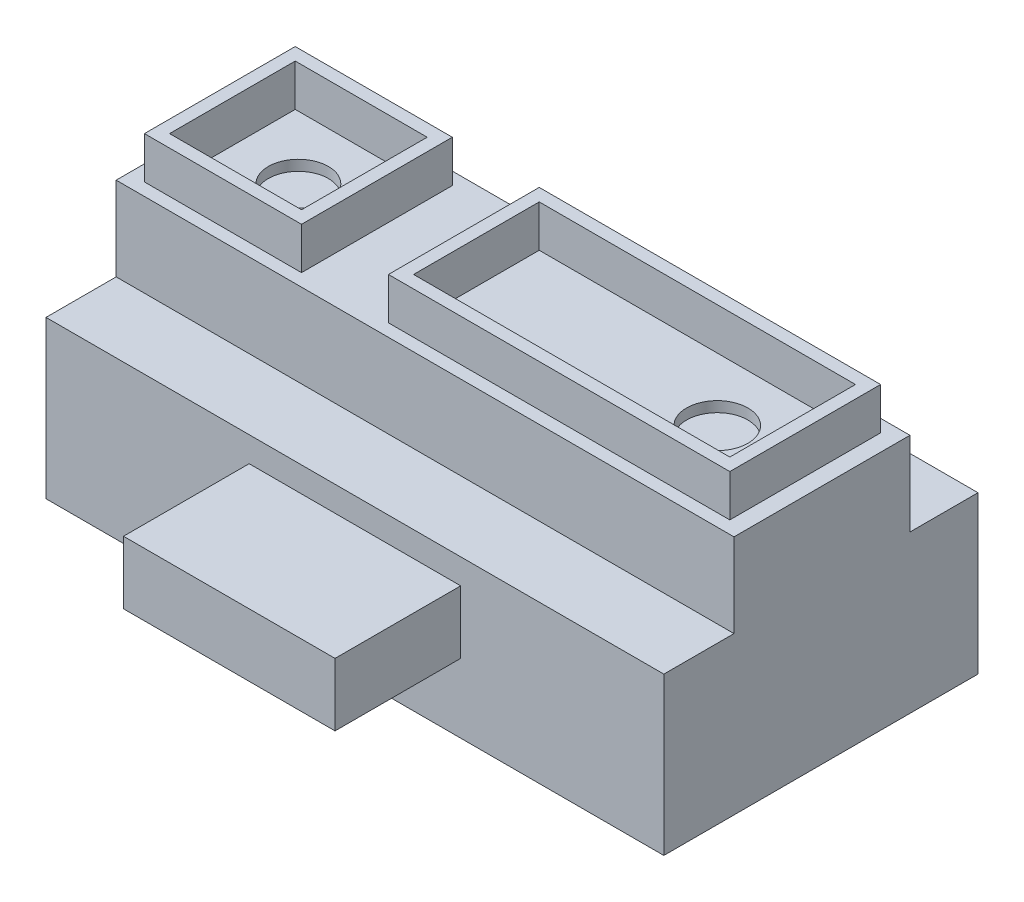
ISO-10303-21;
HEADER;
FILE_DESCRIPTION(('STEP AP214'),'2;1');
FILE_NAME('part.step','',(''),(''),'','','');
FILE_SCHEMA(('AUTOMOTIVE_DESIGN { 1 0 10303 214 1 1 1 1 }'));
ENDSEC;
DATA;
#1=APPLICATION_CONTEXT('core data for automotive mechanical design processes');
#2=APPLICATION_PROTOCOL_DEFINITION('international standard','automotive_design',2000,#1);
#3=PRODUCT_CONTEXT('',#1,'mechanical');
#4=PRODUCT('Part','Part','',(#3));
#5=PRODUCT_RELATED_PRODUCT_CATEGORY('part','',(#4));
#6=PRODUCT_DEFINITION_FORMATION('','',#4);
#7=PRODUCT_DEFINITION_CONTEXT('part definition',#1,'design');
#8=PRODUCT_DEFINITION('design','',#6,#7);
#9=PRODUCT_DEFINITION_SHAPE('','',#8);
#10=(LENGTH_UNIT() NAMED_UNIT(*) SI_UNIT(.MILLI.,.METRE.));
#11=(NAMED_UNIT(*) PLANE_ANGLE_UNIT() SI_UNIT($,.RADIAN.));
#12=(NAMED_UNIT(*) SI_UNIT($,.STERADIAN.) SOLID_ANGLE_UNIT());
#13=UNCERTAINTY_MEASURE_WITH_UNIT(LENGTH_MEASURE(1.E-05),#10,'distance_accuracy_value','');
#14=(GEOMETRIC_REPRESENTATION_CONTEXT(3) GLOBAL_UNCERTAINTY_ASSIGNED_CONTEXT((#13)) GLOBAL_UNIT_ASSIGNED_CONTEXT((#10,
#11,#12)) REPRESENTATION_CONTEXT('',''));
#15=CARTESIAN_POINT('',(0.,0.,0.));
#16=DIRECTION('',(0.,0.,1.));
#17=DIRECTION('',(1.,0.,0.));
#18=AXIS2_PLACEMENT_3D('',#15,#16,#17);
#19=CARTESIAN_POINT('',(0.,7.5,0.));
#20=DIRECTION('',(0.,0.,-1.));
#21=DIRECTION('',(-1.,0.,0.));
#22=AXIS2_PLACEMENT_3D('',#19,#20,#21);
#23=PLANE('',#22);
#24=DIRECTION('',(1.,0.,0.));
#25=VECTOR('',#24,1.);
#26=CARTESIAN_POINT('',(0.,0.,0.));
#27=LINE('',#26,#25);
#28=CARTESIAN_POINT('',(0.,0.,0.));
#29=VERTEX_POINT('',#28);
#30=CARTESIAN_POINT('',(29.5,0.,0.));
#31=VERTEX_POINT('',#30);
#32=EDGE_CURVE('E500',#29,#31,#27,.T.);
#33=ORIENTED_EDGE('',*,*,#32,.T.);
#34=DIRECTION('',(0.,-1.,0.));
#35=VECTOR('',#34,1.);
#36=CARTESIAN_POINT('',(29.5,7.5,0.));
#37=LINE('',#36,#35);
#38=CARTESIAN_POINT('',(29.5,7.5,0.));
#39=VERTEX_POINT('',#38);
#40=EDGE_CURVE('E45',#39,#31,#37,.T.);
#41=ORIENTED_EDGE('',*,*,#40,.F.);
#42=DIRECTION('',(1.,0.,0.));
#43=VECTOR('',#42,1.);
#44=CARTESIAN_POINT('',(0.,7.5,0.));
#45=LINE('',#44,#43);
#46=CARTESIAN_POINT('',(0.,7.5,0.));
#47=VERTEX_POINT('',#46);
#48=EDGE_CURVE('E472',#47,#39,#45,.T.);
#49=ORIENTED_EDGE('',*,*,#48,.F.);
#50=DIRECTION('',(0.,-1.,0.));
#51=VECTOR('',#50,1.);
#52=CARTESIAN_POINT('',(0.,7.5,0.));
#53=LINE('',#52,#51);
#54=EDGE_CURVE('E11',#47,#29,#53,.T.);
#55=ORIENTED_EDGE('',*,*,#54,.T.);
#56=EDGE_LOOP('',(#33,#41,#49,#55));
#57=FACE_BOUND('',#56,.T.);
#58=DIRECTION('',(0.,-1.,0.));
#59=VECTOR('',#58,1.);
#60=CARTESIAN_POINT('',(9.7,6.3,0.));
#61=LINE('',#60,#59);
#62=CARTESIAN_POINT('',(9.7,6.3,0.));
#63=VERTEX_POINT('',#62);
#64=CARTESIAN_POINT('',(9.7,3.3,0.));
#65=VERTEX_POINT('',#64);
#66=EDGE_CURVE('E267',#63,#65,#61,.T.);
#67=ORIENTED_EDGE('',*,*,#66,.F.);
#68=DIRECTION('',(-1.,0.,0.));
#69=VECTOR('',#68,1.);
#70=CARTESIAN_POINT('',(9.7,6.3,0.));
#71=LINE('',#70,#69);
#72=CARTESIAN_POINT('',(19.8,6.3,0.));
#73=VERTEX_POINT('',#72);
#74=EDGE_CURVE('E264',#73,#63,#71,.T.);
#75=ORIENTED_EDGE('',*,*,#74,.F.);
#76=DIRECTION('',(0.,1.,0.));
#77=VECTOR('',#76,1.);
#78=CARTESIAN_POINT('',(19.8,6.3,0.));
#79=LINE('',#78,#77);
#80=CARTESIAN_POINT('',(19.8,3.3,0.));
#81=VERTEX_POINT('',#80);
#82=EDGE_CURVE('E58',#81,#73,#79,.T.);
#83=ORIENTED_EDGE('',*,*,#82,.F.);
#84=DIRECTION('',(1.,0.,0.));
#85=VECTOR('',#84,1.);
#86=CARTESIAN_POINT('',(9.7,3.3,0.));
#87=LINE('',#86,#85);
#88=EDGE_CURVE('E53',#65,#81,#87,.T.);
#89=ORIENTED_EDGE('',*,*,#88,.F.);
#90=EDGE_LOOP('',(#67,#75,#83,#89));
#91=FACE_BOUND('',#90,.T.);
#92=ADVANCED_FACE('F36',(#57,#91),#23,.F.);
#93=CARTESIAN_POINT('',(0.,11.5,-3.35));
#94=DIRECTION('',(0.,1.,0.));
#95=DIRECTION('',(0.,0.,1.));
#96=AXIS2_PLACEMENT_3D('',#93,#94,#95);
#97=PLANE('',#96);
#98=DIRECTION('',(0.,0.,-1.));
#99=VECTOR('',#98,1.);
#100=CARTESIAN_POINT('',(8.25,11.5,-7.55));
#101=LINE('',#100,#99);
#102=CARTESIAN_POINT('',(8.25,11.5,-3.95));
#103=VERTEX_POINT('',#102);
#104=CARTESIAN_POINT('',(8.25,11.5,-11.15));
#105=VERTEX_POINT('',#104);
#106=EDGE_CURVE('E377',#103,#105,#101,.T.);
#107=ORIENTED_EDGE('',*,*,#106,.F.);
#108=DIRECTION('',(1.,0.,0.));
#109=VECTOR('',#108,1.);
#110=CARTESIAN_POINT('',(-9.24912556263572,11.5,-3.95));
#111=LINE('',#110,#109);
#112=CARTESIAN_POINT('',(0.749999999999999,11.5,-3.95));
#113=VERTEX_POINT('',#112);
#114=EDGE_CURVE('E340',#113,#103,#111,.T.);
#115=ORIENTED_EDGE('',*,*,#114,.F.);
#116=DIRECTION('',(0.,0.,-1.));
#117=VECTOR('',#116,1.);
#118=CARTESIAN_POINT('',(0.750000000000001,11.5,-7.55));
#119=LINE('',#118,#117);
#120=CARTESIAN_POINT('',(0.750000000000001,11.5,-11.15));
#121=VERTEX_POINT('',#120);
#122=EDGE_CURVE('E382',#113,#121,#119,.T.);
#123=ORIENTED_EDGE('',*,*,#122,.T.);
#124=DIRECTION('',(1.,0.,0.));
#125=VECTOR('',#124,1.);
#126=CARTESIAN_POINT('',(-9.24912556263572,11.5,-11.15));
#127=LINE('',#126,#125);
#128=EDGE_CURVE('E380',#121,#105,#127,.T.);
#129=ORIENTED_EDGE('',*,*,#128,.T.);
#130=EDGE_LOOP('',(#107,#115,#123,#129));
#131=FACE_BOUND('',#130,.T.);
#132=DIRECTION('',(0.,0.,1.));
#133=VECTOR('',#132,1.);
#134=CARTESIAN_POINT('',(0.,11.5,-11.75));
#135=LINE('',#134,#133);
#136=CARTESIAN_POINT('',(0.,11.5,-11.75));
#137=VERTEX_POINT('',#136);
#138=CARTESIAN_POINT('',(0.,11.5,-3.35));
#139=VERTEX_POINT('',#138);
#140=EDGE_CURVE('E417',#137,#139,#135,.T.);
#141=ORIENTED_EDGE('',*,*,#140,.T.);
#142=DIRECTION('',(1.,0.,0.));
#143=VECTOR('',#142,1.);
#144=CARTESIAN_POINT('',(0.,11.5,-3.35));
#145=LINE('',#144,#143);
#146=CARTESIAN_POINT('',(29.5,11.5,-3.35));
#147=VERTEX_POINT('',#146);
#148=EDGE_CURVE('E420',#139,#147,#145,.T.);
#149=ORIENTED_EDGE('',*,*,#148,.T.);
#150=DIRECTION('',(0.,0.,-1.));
#151=VECTOR('',#150,1.);
#152=CARTESIAN_POINT('',(29.5,11.5,-3.35));
#153=LINE('',#152,#151);
#154=CARTESIAN_POINT('',(29.5,11.5,-11.75));
#155=VERTEX_POINT('',#154);
#156=EDGE_CURVE('E423',#147,#155,#153,.T.);
#157=ORIENTED_EDGE('',*,*,#156,.T.);
#158=DIRECTION('',(-1.,0.,0.));
#159=VECTOR('',#158,1.);
#160=CARTESIAN_POINT('',(29.5,11.5,-11.75));
#161=LINE('',#160,#159);
#162=EDGE_CURVE('E425',#155,#137,#161,.T.);
#163=ORIENTED_EDGE('',*,*,#162,.T.);
#164=EDGE_LOOP('',(#141,#149,#157,#163));
#165=FACE_BOUND('',#164,.T.);
#166=DIRECTION('',(0.,0.,-1.));
#167=VECTOR('',#166,1.);
#168=CARTESIAN_POINT('',(28.7,11.5,-7.55));
#169=LINE('',#168,#167);
#170=CARTESIAN_POINT('',(28.7,11.5,-3.95));
#171=VERTEX_POINT('',#170);
#172=CARTESIAN_POINT('',(28.7,11.5,-11.15));
#173=VERTEX_POINT('',#172);
#174=EDGE_CURVE('E321',#171,#173,#169,.T.);
#175=ORIENTED_EDGE('',*,*,#174,.F.);
#176=DIRECTION('',(1.,0.,0.));
#177=VECTOR('',#176,1.);
#178=CARTESIAN_POINT('',(-9.24912556263572,11.5,-3.95));
#179=LINE('',#178,#177);
#180=CARTESIAN_POINT('',(12.4,11.5,-3.95));
#181=VERTEX_POINT('',#180);
#182=EDGE_CURVE('E318',#181,#171,#179,.T.);
#183=ORIENTED_EDGE('',*,*,#182,.F.);
#184=DIRECTION('',(0.,0.,-1.));
#185=VECTOR('',#184,1.);
#186=CARTESIAN_POINT('',(12.4,11.5,-7.55));
#187=LINE('',#186,#185);
#188=CARTESIAN_POINT('',(12.4,11.5,-11.15));
#189=VERTEX_POINT('',#188);
#190=EDGE_CURVE('E290',#181,#189,#187,.T.);
#191=ORIENTED_EDGE('',*,*,#190,.T.);
#192=DIRECTION('',(1.,0.,0.));
#193=VECTOR('',#192,1.);
#194=CARTESIAN_POINT('',(-9.24912556263572,11.5,-11.15));
#195=LINE('',#194,#193);
#196=EDGE_CURVE('E324',#189,#173,#195,.T.);
#197=ORIENTED_EDGE('',*,*,#196,.T.);
#198=EDGE_LOOP('',(#175,#183,#191,#197));
#199=FACE_BOUND('',#198,.T.);
#200=ADVANCED_FACE('F569',(#131,#165,#199),#97,.T.);
#201=CARTESIAN_POINT('',(0.,7.5,-15.));
#202=DIRECTION('',(0.,-1.,0.));
#203=DIRECTION('',(0.,0.,-1.));
#204=AXIS2_PLACEMENT_3D('',#201,#202,#203);
#205=PLANE('',#204);
#206=DIRECTION('',(-1.,0.,0.));
#207=VECTOR('',#206,1.);
#208=CARTESIAN_POINT('',(29.5,7.5,-11.75));
#209=LINE('',#208,#207);
#210=CARTESIAN_POINT('',(29.5,7.5,-11.75));
#211=VERTEX_POINT('',#210);
#212=CARTESIAN_POINT('',(0.,7.5,-11.75));
#213=VERTEX_POINT('',#212);
#214=EDGE_CURVE('E421',#211,#213,#209,.T.);
#215=ORIENTED_EDGE('',*,*,#214,.F.);
#216=DIRECTION('',(0.,0.,-1.));
#217=VECTOR('',#216,1.);
#218=CARTESIAN_POINT('',(29.5,7.5,0.));
#219=LINE('',#218,#217);
#220=CARTESIAN_POINT('',(29.5,7.5,-15.));
#221=VERTEX_POINT('',#220);
#222=EDGE_CURVE('E436',#211,#221,#219,.T.);
#223=ORIENTED_EDGE('',*,*,#222,.T.);
#224=DIRECTION('',(-1.,0.,0.));
#225=VECTOR('',#224,1.);
#226=CARTESIAN_POINT('',(0.,7.5,-15.));
#227=LINE('',#226,#225);
#228=CARTESIAN_POINT('',(0.,7.5,-15.));
#229=VERTEX_POINT('',#228);
#230=EDGE_CURVE('E473',#221,#229,#227,.T.);
#231=ORIENTED_EDGE('',*,*,#230,.T.);
#232=DIRECTION('',(0.,0.,1.));
#233=VECTOR('',#232,1.);
#234=CARTESIAN_POINT('',(0.,7.5,0.));
#235=LINE('',#234,#233);
#236=EDGE_CURVE('E474',#229,#213,#235,.T.);
#237=ORIENTED_EDGE('',*,*,#236,.T.);
#238=EDGE_LOOP('',(#215,#223,#231,#237));
#239=FACE_BOUND('',#238,.T.);
#240=ADVANCED_FACE('F573',(#239),#205,.F.);
#241=DIRECTION('',(1.,0.,0.));
#242=VECTOR('',#241,1.);
#243=CARTESIAN_POINT('',(0.,7.5,-3.35));
#244=LINE('',#243,#242);
#245=CARTESIAN_POINT('',(0.,7.5,-3.35));
#246=VERTEX_POINT('',#245);
#247=CARTESIAN_POINT('',(29.5,7.5,-3.35));
#248=VERTEX_POINT('',#247);
#249=EDGE_CURVE('E406',#246,#248,#244,.T.);
#250=ORIENTED_EDGE('',*,*,#249,.F.);
#251=EDGE_CURVE('E479',#246,#47,#235,.T.);
#252=ORIENTED_EDGE('',*,*,#251,.T.);
#253=ORIENTED_EDGE('',*,*,#48,.T.);
#254=EDGE_CURVE('E471',#39,#248,#219,.T.);
#255=ORIENTED_EDGE('',*,*,#254,.T.);
#256=EDGE_LOOP('',(#250,#252,#253,#255));
#257=FACE_BOUND('',#256,.T.);
#258=ADVANCED_FACE('F592',(#257),#205,.F.);
#259=CARTESIAN_POINT('',(0.,7.5,0.));
#260=DIRECTION('',(1.,0.,0.));
#261=DIRECTION('',(0.,0.,-1.));
#262=AXIS2_PLACEMENT_3D('',#259,#260,#261);
#263=PLANE('',#262);
#264=DIRECTION('',(0.,0.,1.));
#265=VECTOR('',#264,1.);
#266=CARTESIAN_POINT('',(0.,0.,0.));
#267=LINE('',#266,#265);
#268=CARTESIAN_POINT('',(0.,0.,-15.));
#269=VERTEX_POINT('',#268);
#270=EDGE_CURVE('E501',#269,#29,#267,.T.);
#271=ORIENTED_EDGE('',*,*,#270,.T.);
#272=ORIENTED_EDGE('',*,*,#54,.F.);
#273=ORIENTED_EDGE('',*,*,#251,.F.);
#274=DIRECTION('',(0.,-1.,0.));
#275=VECTOR('',#274,1.);
#276=CARTESIAN_POINT('',(0.,11.5,-3.35));
#277=LINE('',#276,#275);
#278=EDGE_CURVE('E442',#139,#246,#277,.T.);
#279=ORIENTED_EDGE('',*,*,#278,.F.);
#280=ORIENTED_EDGE('',*,*,#140,.F.);
#281=DIRECTION('',(0.,-1.,0.));
#282=VECTOR('',#281,1.);
#283=CARTESIAN_POINT('',(0.,11.5,-11.75));
#284=LINE('',#283,#282);
#285=EDGE_CURVE('E427',#137,#213,#284,.T.);
#286=ORIENTED_EDGE('',*,*,#285,.T.);
#287=ORIENTED_EDGE('',*,*,#236,.F.);
#288=DIRECTION('',(0.,-1.,0.));
#289=VECTOR('',#288,1.);
#290=CARTESIAN_POINT('',(0.,7.5,-15.));
#291=LINE('',#290,#289);
#292=EDGE_CURVE('E494',#229,#269,#291,.T.);
#293=ORIENTED_EDGE('',*,*,#292,.T.);
#294=EDGE_LOOP('',(#271,#272,#273,#279,#280,#286,#287,#293));
#295=FACE_BOUND('',#294,.T.);
#296=ADVANCED_FACE('F38',(#295),#263,.F.);
#297=CARTESIAN_POINT('',(29.5,7.5,0.));
#298=DIRECTION('',(-1.,0.,0.));
#299=DIRECTION('',(0.,0.,1.));
#300=AXIS2_PLACEMENT_3D('',#297,#298,#299);
#301=PLANE('',#300);
#302=DIRECTION('',(0.,0.,-1.));
#303=VECTOR('',#302,1.);
#304=CARTESIAN_POINT('',(29.5,0.,0.));
#305=LINE('',#304,#303);
#306=CARTESIAN_POINT('',(29.5,0.,-15.));
#307=VERTEX_POINT('',#306);
#308=EDGE_CURVE('E498',#31,#307,#305,.T.);
#309=ORIENTED_EDGE('',*,*,#308,.T.);
#310=DIRECTION('',(0.,-1.,0.));
#311=VECTOR('',#310,1.);
#312=CARTESIAN_POINT('',(29.5,7.5,-15.));
#313=LINE('',#312,#311);
#314=EDGE_CURVE('E468',#221,#307,#313,.T.);
#315=ORIENTED_EDGE('',*,*,#314,.F.);
#316=ORIENTED_EDGE('',*,*,#222,.F.);
#317=DIRECTION('',(0.,-1.,0.));
#318=VECTOR('',#317,1.);
#319=CARTESIAN_POINT('',(29.5,11.5,-11.75));
#320=LINE('',#319,#318);
#321=EDGE_CURVE('E443',#155,#211,#320,.T.);
#322=ORIENTED_EDGE('',*,*,#321,.F.);
#323=ORIENTED_EDGE('',*,*,#156,.F.);
#324=DIRECTION('',(0.,-1.,0.));
#325=VECTOR('',#324,1.);
#326=CARTESIAN_POINT('',(29.5,11.5,-3.35));
#327=LINE('',#326,#325);
#328=EDGE_CURVE('E439',#147,#248,#327,.T.);
#329=ORIENTED_EDGE('',*,*,#328,.T.);
#330=ORIENTED_EDGE('',*,*,#254,.F.);
#331=ORIENTED_EDGE('',*,*,#40,.T.);
#332=EDGE_LOOP('',(#309,#315,#316,#322,#323,#329,#330,#331));
#333=FACE_BOUND('',#332,.T.);
#334=ADVANCED_FACE('F465',(#333),#301,.F.);
#335=CARTESIAN_POINT('',(0.,7.5,-15.));
#336=DIRECTION('',(0.,0.,1.));
#337=DIRECTION('',(1.,0.,0.));
#338=AXIS2_PLACEMENT_3D('',#335,#336,#337);
#339=PLANE('',#338);
#340=DIRECTION('',(-1.,0.,0.));
#341=VECTOR('',#340,1.);
#342=CARTESIAN_POINT('',(0.,0.,-15.));
#343=LINE('',#342,#341);
#344=EDGE_CURVE('E489',#307,#269,#343,.T.);
#345=ORIENTED_EDGE('',*,*,#344,.T.);
#346=ORIENTED_EDGE('',*,*,#292,.F.);
#347=ORIENTED_EDGE('',*,*,#230,.F.);
#348=ORIENTED_EDGE('',*,*,#314,.T.);
#349=EDGE_LOOP('',(#345,#346,#347,#348));
#350=FACE_BOUND('',#349,.T.);
#351=ADVANCED_FACE('F557',(#350),#339,.F.);
#352=CARTESIAN_POINT('',(0.,0.,-15.));
#353=DIRECTION('',(0.,-1.,0.));
#354=DIRECTION('',(0.,0.,-1.));
#355=AXIS2_PLACEMENT_3D('',#352,#353,#354);
#356=PLANE('',#355);
#357=DIRECTION('',(-1.,0.,0.));
#358=VECTOR('',#357,1.);
#359=CARTESIAN_POINT('',(28.7,0.,-0.8));
#360=LINE('',#359,#358);
#361=CARTESIAN_POINT('',(28.7,0.,-0.8));
#362=VERTEX_POINT('',#361);
#363=CARTESIAN_POINT('',(0.8,0.,-0.8));
#364=VERTEX_POINT('',#363);
#365=EDGE_CURVE('E448',#362,#364,#360,.T.);
#366=ORIENTED_EDGE('',*,*,#365,.F.);
#367=DIRECTION('',(0.,0.,1.));
#368=VECTOR('',#367,1.);
#369=CARTESIAN_POINT('',(28.7,0.,-14.2));
#370=LINE('',#369,#368);
#371=CARTESIAN_POINT('',(28.7,0.,-14.2));
#372=VERTEX_POINT('',#371);
#373=EDGE_CURVE('E515',#372,#362,#370,.T.);
#374=ORIENTED_EDGE('',*,*,#373,.F.);
#375=DIRECTION('',(1.,0.,0.));
#376=VECTOR('',#375,1.);
#377=CARTESIAN_POINT('',(0.799999999999993,0.,-14.2));
#378=LINE('',#377,#376);
#379=CARTESIAN_POINT('',(0.799999999999993,0.,-14.2));
#380=VERTEX_POINT('',#379);
#381=EDGE_CURVE('E538',#380,#372,#378,.T.);
#382=ORIENTED_EDGE('',*,*,#381,.F.);
#383=DIRECTION('',(0.,0.,-1.));
#384=VECTOR('',#383,1.);
#385=CARTESIAN_POINT('',(0.8,0.,-0.8));
#386=LINE('',#385,#384);
#387=EDGE_CURVE('E537',#364,#380,#386,.T.);
#388=ORIENTED_EDGE('',*,*,#387,.F.);
#389=EDGE_LOOP('',(#366,#374,#382,#388));
#390=FACE_BOUND('',#389,.T.);
#391=ORIENTED_EDGE('',*,*,#270,.F.);
#392=ORIENTED_EDGE('',*,*,#344,.F.);
#393=ORIENTED_EDGE('',*,*,#308,.F.);
#394=ORIENTED_EDGE('',*,*,#32,.F.);
#395=EDGE_LOOP('',(#391,#392,#393,#394));
#396=FACE_BOUND('',#395,.T.);
#397=ADVANCED_FACE('F554',(#390,#396),#356,.T.);
#398=CARTESIAN_POINT('',(28.7,5.7,-0.8));
#399=DIRECTION('',(0.,0.,1.));
#400=DIRECTION('',(1.,0.,0.));
#401=AXIS2_PLACEMENT_3D('',#398,#399,#400);
#402=PLANE('',#401);
#403=ORIENTED_EDGE('',*,*,#365,.T.);
#404=DIRECTION('',(0.,-1.,0.));
#405=VECTOR('',#404,1.);
#406=CARTESIAN_POINT('',(0.8,5.7,-0.8));
#407=LINE('',#406,#405);
#408=CARTESIAN_POINT('',(0.8,5.7,-0.8));
#409=VERTEX_POINT('',#408);
#410=EDGE_CURVE('E518',#409,#364,#407,.T.);
#411=ORIENTED_EDGE('',*,*,#410,.F.);
#412=DIRECTION('',(-1.,0.,0.));
#413=VECTOR('',#412,1.);
#414=CARTESIAN_POINT('',(28.7,5.7,-0.8));
#415=LINE('',#414,#413);
#416=CARTESIAN_POINT('',(28.7,5.7,-0.8));
#417=VERTEX_POINT('',#416);
#418=EDGE_CURVE('E543',#417,#409,#415,.T.);
#419=ORIENTED_EDGE('',*,*,#418,.F.);
#420=DIRECTION('',(0.,-1.,0.));
#421=VECTOR('',#420,1.);
#422=CARTESIAN_POINT('',(28.7,5.7,-0.8));
#423=LINE('',#422,#421);
#424=EDGE_CURVE('E503',#417,#362,#423,.T.);
#425=ORIENTED_EDGE('',*,*,#424,.T.);
#426=EDGE_LOOP('',(#403,#411,#419,#425));
#427=FACE_BOUND('',#426,.T.);
#428=ADVANCED_FACE('F552',(#427),#402,.F.);
#429=CARTESIAN_POINT('',(28.7,5.7,-14.2));
#430=DIRECTION('',(1.,0.,0.));
#431=DIRECTION('',(0.,0.,-1.));
#432=AXIS2_PLACEMENT_3D('',#429,#430,#431);
#433=PLANE('',#432);
#434=ORIENTED_EDGE('',*,*,#373,.T.);
#435=ORIENTED_EDGE('',*,*,#424,.F.);
#436=DIRECTION('',(0.,0.,1.));
#437=VECTOR('',#436,1.);
#438=CARTESIAN_POINT('',(28.7,5.7,-14.2));
#439=LINE('',#438,#437);
#440=CARTESIAN_POINT('',(28.7,5.7,-14.2));
#441=VERTEX_POINT('',#440);
#442=EDGE_CURVE('E520',#441,#417,#439,.T.);
#443=ORIENTED_EDGE('',*,*,#442,.F.);
#444=DIRECTION('',(0.,-1.,0.));
#445=VECTOR('',#444,1.);
#446=CARTESIAN_POINT('',(28.7,5.7,-14.2));
#447=LINE('',#446,#445);
#448=EDGE_CURVE('E507',#441,#372,#447,.T.);
#449=ORIENTED_EDGE('',*,*,#448,.T.);
#450=EDGE_LOOP('',(#434,#435,#443,#449));
#451=FACE_BOUND('',#450,.T.);
#452=ADVANCED_FACE('F551',(#451),#433,.F.);
#453=CARTESIAN_POINT('',(0.799999999999993,5.7,-14.2));
#454=DIRECTION('',(0.,0.,-1.));
#455=DIRECTION('',(-1.,0.,0.));
#456=AXIS2_PLACEMENT_3D('',#453,#454,#455);
#457=PLANE('',#456);
#458=ORIENTED_EDGE('',*,*,#381,.T.);
#459=ORIENTED_EDGE('',*,*,#448,.F.);
#460=DIRECTION('',(1.,0.,0.));
#461=VECTOR('',#460,1.);
#462=CARTESIAN_POINT('',(0.799999999999993,5.7,-14.2));
#463=LINE('',#462,#461);
#464=CARTESIAN_POINT('',(0.799999999999993,5.7,-14.2));
#465=VERTEX_POINT('',#464);
#466=EDGE_CURVE('E526',#465,#441,#463,.T.);
#467=ORIENTED_EDGE('',*,*,#466,.F.);
#468=DIRECTION('',(0.,-1.,0.));
#469=VECTOR('',#468,1.);
#470=CARTESIAN_POINT('',(0.799999999999993,5.7,-14.2));
#471=LINE('',#470,#469);
#472=EDGE_CURVE('E512',#465,#380,#471,.T.);
#473=ORIENTED_EDGE('',*,*,#472,.T.);
#474=EDGE_LOOP('',(#458,#459,#467,#473));
#475=FACE_BOUND('',#474,.T.);
#476=ADVANCED_FACE('F550',(#475),#457,.F.);
#477=CARTESIAN_POINT('',(0.8,5.7,-0.8));
#478=DIRECTION('',(-1.,0.,0.));
#479=DIRECTION('',(0.,0.,1.));
#480=AXIS2_PLACEMENT_3D('',#477,#478,#479);
#481=PLANE('',#480);
#482=ORIENTED_EDGE('',*,*,#387,.T.);
#483=ORIENTED_EDGE('',*,*,#472,.F.);
#484=DIRECTION('',(0.,0.,-1.));
#485=VECTOR('',#484,1.);
#486=CARTESIAN_POINT('',(0.8,5.7,-0.8));
#487=LINE('',#486,#485);
#488=EDGE_CURVE('E532',#409,#465,#487,.T.);
#489=ORIENTED_EDGE('',*,*,#488,.F.);
#490=ORIENTED_EDGE('',*,*,#410,.T.);
#491=EDGE_LOOP('',(#482,#483,#489,#490));
#492=FACE_BOUND('',#491,.T.);
#493=ADVANCED_FACE('F549',(#492),#481,.F.);
#494=CARTESIAN_POINT('',(0.8,5.7,-0.8));
#495=DIRECTION('',(0.,-1.,0.));
#496=DIRECTION('',(0.,0.,-1.));
#497=AXIS2_PLACEMENT_3D('',#494,#495,#496);
#498=PLANE('',#497);
#499=ORIENTED_EDGE('',*,*,#418,.T.);
#500=ORIENTED_EDGE('',*,*,#488,.T.);
#501=ORIENTED_EDGE('',*,*,#466,.T.);
#502=ORIENTED_EDGE('',*,*,#442,.T.);
#503=EDGE_LOOP('',(#499,#500,#501,#502));
#504=FACE_BOUND('',#503,.T.);
#505=ADVANCED_FACE('F547',(#504),#498,.T.);
#506=CARTESIAN_POINT('',(0.,11.5,-3.35));
#507=DIRECTION('',(0.,0.,-1.));
#508=DIRECTION('',(-1.,0.,0.));
#509=AXIS2_PLACEMENT_3D('',#506,#507,#508);
#510=PLANE('',#509);
#511=ORIENTED_EDGE('',*,*,#249,.T.);
#512=ORIENTED_EDGE('',*,*,#328,.F.);
#513=ORIENTED_EDGE('',*,*,#148,.F.);
#514=ORIENTED_EDGE('',*,*,#278,.T.);
#515=EDGE_LOOP('',(#511,#512,#513,#514));
#516=FACE_BOUND('',#515,.T.);
#517=ADVANCED_FACE('F566',(#516),#510,.F.);
#518=CARTESIAN_POINT('',(29.5,11.5,-11.75));
#519=DIRECTION('',(0.,0.,1.));
#520=DIRECTION('',(1.,0.,0.));
#521=AXIS2_PLACEMENT_3D('',#518,#519,#520);
#522=PLANE('',#521);
#523=ORIENTED_EDGE('',*,*,#214,.T.);
#524=ORIENTED_EDGE('',*,*,#285,.F.);
#525=ORIENTED_EDGE('',*,*,#162,.F.);
#526=ORIENTED_EDGE('',*,*,#321,.T.);
#527=EDGE_LOOP('',(#523,#524,#525,#526));
#528=FACE_BOUND('',#527,.T.);
#529=ADVANCED_FACE('F460',(#528),#522,.F.);
#530=CARTESIAN_POINT('',(-9.24912556263572,13.5,-4.55));
#531=DIRECTION('',(0.,0.,-1.));
#532=DIRECTION('',(-1.,0.,0.));
#533=AXIS2_PLACEMENT_3D('',#530,#531,#532);
#534=PLANE('',#533);
#535=DIRECTION('',(1.,0.,0.));
#536=VECTOR('',#535,1.);
#537=CARTESIAN_POINT('',(-9.24912556263572,11.5,-4.55));
#538=LINE('',#537,#536);
#539=CARTESIAN_POINT('',(1.35,11.5,-4.55));
#540=VERTEX_POINT('',#539);
#541=CARTESIAN_POINT('',(7.65,11.5,-4.55));
#542=VERTEX_POINT('',#541);
#543=EDGE_CURVE('E384',#540,#542,#538,.T.);
#544=ORIENTED_EDGE('',*,*,#543,.F.);
#545=DIRECTION('',(0.,-1.,0.));
#546=VECTOR('',#545,1.);
#547=CARTESIAN_POINT('',(1.35,13.5,-4.55));
#548=LINE('',#547,#546);
#549=CARTESIAN_POINT('',(1.35,13.5,-4.55));
#550=VERTEX_POINT('',#549);
#551=EDGE_CURVE('E403',#550,#540,#548,.T.);
#552=ORIENTED_EDGE('',*,*,#551,.F.);
#553=DIRECTION('',(1.,0.,0.));
#554=VECTOR('',#553,1.);
#555=CARTESIAN_POINT('',(-9.24912556263572,13.5,-4.55));
#556=LINE('',#555,#554);
#557=CARTESIAN_POINT('',(7.65,13.5,-4.55));
#558=VERTEX_POINT('',#557);
#559=EDGE_CURVE('E363',#550,#558,#556,.T.);
#560=ORIENTED_EDGE('',*,*,#559,.T.);
#561=DIRECTION('',(0.,-1.,0.));
#562=VECTOR('',#561,1.);
#563=CARTESIAN_POINT('',(7.65,13.5,-4.55));
#564=LINE('',#563,#562);
#565=EDGE_CURVE('E393',#558,#542,#564,.T.);
#566=ORIENTED_EDGE('',*,*,#565,.T.);
#567=EDGE_LOOP('',(#544,#552,#560,#566));
#568=FACE_BOUND('',#567,.T.);
#569=ADVANCED_FACE('F619',(#568),#534,.T.);
#570=CARTESIAN_POINT('',(1.35,13.5,-7.55));
#571=DIRECTION('',(-1.,0.,0.));
#572=DIRECTION('',(0.,0.,1.));
#573=AXIS2_PLACEMENT_3D('',#570,#571,#572);
#574=PLANE('',#573);
#575=DIRECTION('',(0.,0.,-1.));
#576=VECTOR('',#575,1.);
#577=CARTESIAN_POINT('',(1.35,11.5,-7.55));
#578=LINE('',#577,#576);
#579=CARTESIAN_POINT('',(1.35,11.5,-10.55));
#580=VERTEX_POINT('',#579);
#581=EDGE_CURVE('E386',#540,#580,#578,.T.);
#582=ORIENTED_EDGE('',*,*,#581,.T.);
#583=DIRECTION('',(0.,-1.,0.));
#584=VECTOR('',#583,1.);
#585=CARTESIAN_POINT('',(1.35,13.5,-10.55));
#586=LINE('',#585,#584);
#587=CARTESIAN_POINT('',(1.35,13.5,-10.55));
#588=VERTEX_POINT('',#587);
#589=EDGE_CURVE('E400',#588,#580,#586,.T.);
#590=ORIENTED_EDGE('',*,*,#589,.F.);
#591=DIRECTION('',(0.,0.,-1.));
#592=VECTOR('',#591,1.);
#593=CARTESIAN_POINT('',(1.35,13.5,-7.55));
#594=LINE('',#593,#592);
#595=EDGE_CURVE('E366',#550,#588,#594,.T.);
#596=ORIENTED_EDGE('',*,*,#595,.F.);
#597=ORIENTED_EDGE('',*,*,#551,.T.);
#598=EDGE_LOOP('',(#582,#590,#596,#597));
#599=FACE_BOUND('',#598,.T.);
#600=ADVANCED_FACE('F629',(#599),#574,.F.);
#601=CARTESIAN_POINT('',(-9.24912556263572,13.5,-10.55));
#602=DIRECTION('',(0.,0.,-1.));
#603=DIRECTION('',(-1.,0.,0.));
#604=AXIS2_PLACEMENT_3D('',#601,#602,#603);
#605=PLANE('',#604);
#606=DIRECTION('',(1.,0.,0.));
#607=VECTOR('',#606,1.);
#608=CARTESIAN_POINT('',(-9.24912556263572,11.5,-10.55));
#609=LINE('',#608,#607);
#610=CARTESIAN_POINT('',(7.65,11.5,-10.55));
#611=VERTEX_POINT('',#610);
#612=EDGE_CURVE('E389',#580,#611,#609,.T.);
#613=ORIENTED_EDGE('',*,*,#612,.T.);
#614=DIRECTION('',(0.,-1.,0.));
#615=VECTOR('',#614,1.);
#616=CARTESIAN_POINT('',(7.65,13.5,-10.55));
#617=LINE('',#616,#615);
#618=CARTESIAN_POINT('',(7.65,13.5,-10.55));
#619=VERTEX_POINT('',#618);
#620=EDGE_CURVE('E396',#619,#611,#617,.T.);
#621=ORIENTED_EDGE('',*,*,#620,.F.);
#622=DIRECTION('',(1.,0.,0.));
#623=VECTOR('',#622,1.);
#624=CARTESIAN_POINT('',(-9.24912556263572,13.5,-10.55));
#625=LINE('',#624,#623);
#626=EDGE_CURVE('E369',#588,#619,#625,.T.);
#627=ORIENTED_EDGE('',*,*,#626,.F.);
#628=ORIENTED_EDGE('',*,*,#589,.T.);
#629=EDGE_LOOP('',(#613,#621,#627,#628));
#630=FACE_BOUND('',#629,.T.);
#631=ADVANCED_FACE('F625',(#630),#605,.F.);
#632=CARTESIAN_POINT('',(-9.24912556263572,13.5,-3.95));
#633=DIRECTION('',(0.,0.,-1.));
#634=DIRECTION('',(-1.,0.,0.));
#635=AXIS2_PLACEMENT_3D('',#632,#633,#634);
#636=PLANE('',#635);
#637=ORIENTED_EDGE('',*,*,#114,.T.);
#638=DIRECTION('',(0.,-1.,0.));
#639=VECTOR('',#638,1.);
#640=CARTESIAN_POINT('',(8.25,13.5,-3.95));
#641=LINE('',#640,#639);
#642=CARTESIAN_POINT('',(8.25,13.5,-3.95));
#643=VERTEX_POINT('',#642);
#644=EDGE_CURVE('E397',#643,#103,#641,.T.);
#645=ORIENTED_EDGE('',*,*,#644,.F.);
#646=DIRECTION('',(1.,0.,0.));
#647=VECTOR('',#646,1.);
#648=CARTESIAN_POINT('',(-9.24912556263572,13.5,-3.95));
#649=LINE('',#648,#647);
#650=CARTESIAN_POINT('',(0.749999999999999,13.5,-3.95));
#651=VERTEX_POINT('',#650);
#652=EDGE_CURVE('E351',#651,#643,#649,.T.);
#653=ORIENTED_EDGE('',*,*,#652,.F.);
#654=DIRECTION('',(0.,-1.,0.));
#655=VECTOR('',#654,1.);
#656=CARTESIAN_POINT('',(0.749999999999999,13.5,-3.95));
#657=LINE('',#656,#655);
#658=EDGE_CURVE('E374',#651,#113,#657,.T.);
#659=ORIENTED_EDGE('',*,*,#658,.T.);
#660=EDGE_LOOP('',(#637,#645,#653,#659));
#661=FACE_BOUND('',#660,.T.);
#662=ADVANCED_FACE('F637',(#661),#636,.F.);
#663=CARTESIAN_POINT('',(8.25,13.5,-7.55));
#664=DIRECTION('',(-1.,0.,0.));
#665=DIRECTION('',(0.,0.,1.));
#666=AXIS2_PLACEMENT_3D('',#663,#664,#665);
#667=PLANE('',#666);
#668=ORIENTED_EDGE('',*,*,#106,.T.);
#669=DIRECTION('',(0.,-1.,0.));
#670=VECTOR('',#669,1.);
#671=CARTESIAN_POINT('',(8.25,13.5,-11.15));
#672=LINE('',#671,#670);
#673=CARTESIAN_POINT('',(8.25,13.5,-11.15));
#674=VERTEX_POINT('',#673);
#675=EDGE_CURVE('E412',#674,#105,#672,.T.);
#676=ORIENTED_EDGE('',*,*,#675,.F.);
#677=DIRECTION('',(0.,0.,-1.));
#678=VECTOR('',#677,1.);
#679=CARTESIAN_POINT('',(8.25,13.5,-7.55));
#680=LINE('',#679,#678);
#681=EDGE_CURVE('E354',#643,#674,#680,.T.);
#682=ORIENTED_EDGE('',*,*,#681,.F.);
#683=ORIENTED_EDGE('',*,*,#644,.T.);
#684=EDGE_LOOP('',(#668,#676,#682,#683));
#685=FACE_BOUND('',#684,.T.);
#686=ADVANCED_FACE('F649',(#685),#667,.F.);
#687=CARTESIAN_POINT('',(-9.24912556263572,13.5,-11.15));
#688=DIRECTION('',(0.,0.,-1.));
#689=DIRECTION('',(-1.,0.,0.));
#690=AXIS2_PLACEMENT_3D('',#687,#688,#689);
#691=PLANE('',#690);
#692=ORIENTED_EDGE('',*,*,#128,.F.);
#693=DIRECTION('',(0.,-1.,0.));
#694=VECTOR('',#693,1.);
#695=CARTESIAN_POINT('',(0.750000000000001,13.5,-11.15));
#696=LINE('',#695,#694);
#697=CARTESIAN_POINT('',(0.750000000000001,13.5,-11.15));
#698=VERTEX_POINT('',#697);
#699=EDGE_CURVE('E409',#698,#121,#696,.T.);
#700=ORIENTED_EDGE('',*,*,#699,.F.);
#701=DIRECTION('',(1.,0.,0.));
#702=VECTOR('',#701,1.);
#703=CARTESIAN_POINT('',(-9.24912556263572,13.5,-11.15));
#704=LINE('',#703,#702);
#705=EDGE_CURVE('E357',#698,#674,#704,.T.);
#706=ORIENTED_EDGE('',*,*,#705,.T.);
#707=ORIENTED_EDGE('',*,*,#675,.T.);
#708=EDGE_LOOP('',(#692,#700,#706,#707));
#709=FACE_BOUND('',#708,.T.);
#710=ADVANCED_FACE('F645',(#709),#691,.T.);
#711=CARTESIAN_POINT('',(0.750000000000001,13.5,-7.55));
#712=DIRECTION('',(-1.,0.,0.));
#713=DIRECTION('',(0.,0.,1.));
#714=AXIS2_PLACEMENT_3D('',#711,#712,#713);
#715=PLANE('',#714);
#716=ORIENTED_EDGE('',*,*,#122,.F.);
#717=ORIENTED_EDGE('',*,*,#658,.F.);
#718=DIRECTION('',(0.,0.,-1.));
#719=VECTOR('',#718,1.);
#720=CARTESIAN_POINT('',(0.750000000000001,13.5,-7.55));
#721=LINE('',#720,#719);
#722=EDGE_CURVE('E360',#651,#698,#721,.T.);
#723=ORIENTED_EDGE('',*,*,#722,.T.);
#724=ORIENTED_EDGE('',*,*,#699,.T.);
#725=EDGE_LOOP('',(#716,#717,#723,#724));
#726=FACE_BOUND('',#725,.T.);
#727=ADVANCED_FACE('F642',(#726),#715,.T.);
#728=CARTESIAN_POINT('',(7.65,13.5,-7.55));
#729=DIRECTION('',(-1.,0.,0.));
#730=DIRECTION('',(0.,0.,1.));
#731=AXIS2_PLACEMENT_3D('',#728,#729,#730);
#732=PLANE('',#731);
#733=DIRECTION('',(0.,0.,-1.));
#734=VECTOR('',#733,1.);
#735=CARTESIAN_POINT('',(7.65,11.5,-7.55));
#736=LINE('',#735,#734);
#737=EDGE_CURVE('E355',#542,#611,#736,.T.);
#738=ORIENTED_EDGE('',*,*,#737,.F.);
#739=ORIENTED_EDGE('',*,*,#565,.F.);
#740=DIRECTION('',(0.,0.,-1.));
#741=VECTOR('',#740,1.);
#742=CARTESIAN_POINT('',(7.65,13.5,-7.55));
#743=LINE('',#742,#741);
#744=EDGE_CURVE('E371',#558,#619,#743,.T.);
#745=ORIENTED_EDGE('',*,*,#744,.T.);
#746=ORIENTED_EDGE('',*,*,#620,.T.);
#747=EDGE_LOOP('',(#738,#739,#745,#746));
#748=FACE_BOUND('',#747,.T.);
#749=ADVANCED_FACE('F611',(#748),#732,.T.);
#750=CARTESIAN_POINT('',(-9.24912556263572,13.5,-7.55));
#751=DIRECTION('',(0.,1.,0.));
#752=DIRECTION('',(0.,0.,1.));
#753=AXIS2_PLACEMENT_3D('',#750,#751,#752);
#754=PLANE('',#753);
#755=ORIENTED_EDGE('',*,*,#652,.T.);
#756=ORIENTED_EDGE('',*,*,#681,.T.);
#757=ORIENTED_EDGE('',*,*,#705,.F.);
#758=ORIENTED_EDGE('',*,*,#722,.F.);
#759=EDGE_LOOP('',(#755,#756,#757,#758));
#760=FACE_BOUND('',#759,.T.);
#761=ORIENTED_EDGE('',*,*,#559,.F.);
#762=ORIENTED_EDGE('',*,*,#595,.T.);
#763=ORIENTED_EDGE('',*,*,#626,.T.);
#764=ORIENTED_EDGE('',*,*,#744,.F.);
#765=EDGE_LOOP('',(#761,#762,#763,#764));
#766=FACE_BOUND('',#765,.T.);
#767=ADVANCED_FACE('F602',(#760,#766),#754,.T.);
#768=CARTESIAN_POINT('',(4.5,11.5,-7.55));
#769=DIRECTION('',(0.,1.,0.));
#770=DIRECTION('',(0.,0.,1.));
#771=AXIS2_PLACEMENT_3D('',#768,#769,#770);
#772=CIRCLE('',#771,1.43408658456735);
#773=CARTESIAN_POINT('',(4.5,11.5,-6.11591341543265));
#774=VERTEX_POINT('',#773);
#775=EDGE_CURVE('E278',#774,#774,#772,.T.);
#776=ORIENTED_EDGE('',*,*,#775,.F.);
#777=EDGE_LOOP('',(#776));
#778=FACE_BOUND('',#777,.T.);
#779=ORIENTED_EDGE('',*,*,#543,.T.);
#780=ORIENTED_EDGE('',*,*,#737,.T.);
#781=ORIENTED_EDGE('',*,*,#612,.F.);
#782=ORIENTED_EDGE('',*,*,#581,.F.);
#783=EDGE_LOOP('',(#779,#780,#781,#782));
#784=FACE_BOUND('',#783,.T.);
#785=ADVANCED_FACE('F588',(#778,#784),#97,.T.);
#786=CARTESIAN_POINT('',(-9.24912556263572,13.5,-3.95));
#787=DIRECTION('',(0.,0.,-1.));
#788=DIRECTION('',(-1.,0.,0.));
#789=AXIS2_PLACEMENT_3D('',#786,#787,#788);
#790=PLANE('',#789);
#791=ORIENTED_EDGE('',*,*,#182,.T.);
#792=DIRECTION('',(0.,-1.,0.));
#793=VECTOR('',#792,1.);
#794=CARTESIAN_POINT('',(28.7,13.5,-3.95));
#795=LINE('',#794,#793);
#796=CARTESIAN_POINT('',(28.7,13.5,-3.95));
#797=VERTEX_POINT('',#796);
#798=EDGE_CURVE('E337',#797,#171,#795,.T.);
#799=ORIENTED_EDGE('',*,*,#798,.F.);
#800=DIRECTION('',(1.,0.,0.));
#801=VECTOR('',#800,1.);
#802=CARTESIAN_POINT('',(-9.24912556263572,13.5,-3.95));
#803=LINE('',#802,#801);
#804=CARTESIAN_POINT('',(12.4,13.5,-3.95));
#805=VERTEX_POINT('',#804);
#806=EDGE_CURVE('E297',#805,#797,#803,.T.);
#807=ORIENTED_EDGE('',*,*,#806,.F.);
#808=DIRECTION('',(0.,-1.,0.));
#809=VECTOR('',#808,1.);
#810=CARTESIAN_POINT('',(12.4,13.5,-3.95));
#811=LINE('',#810,#809);
#812=EDGE_CURVE('E327',#805,#181,#811,.T.);
#813=ORIENTED_EDGE('',*,*,#812,.T.);
#814=EDGE_LOOP('',(#791,#799,#807,#813));
#815=FACE_BOUND('',#814,.T.);
#816=ADVANCED_FACE('F601',(#815),#790,.F.);
#817=CARTESIAN_POINT('',(28.7,13.5,-7.55));
#818=DIRECTION('',(-1.,0.,0.));
#819=DIRECTION('',(0.,0.,1.));
#820=AXIS2_PLACEMENT_3D('',#817,#818,#819);
#821=PLANE('',#820);
#822=ORIENTED_EDGE('',*,*,#174,.T.);
#823=DIRECTION('',(0.,-1.,0.));
#824=VECTOR('',#823,1.);
#825=CARTESIAN_POINT('',(28.7,13.5,-11.15));
#826=LINE('',#825,#824);
#827=CARTESIAN_POINT('',(28.7,13.5,-11.15));
#828=VERTEX_POINT('',#827);
#829=EDGE_CURVE('E334',#828,#173,#826,.T.);
#830=ORIENTED_EDGE('',*,*,#829,.F.);
#831=DIRECTION('',(0.,0.,-1.));
#832=VECTOR('',#831,1.);
#833=CARTESIAN_POINT('',(28.7,13.5,-7.55));
#834=LINE('',#833,#832);
#835=EDGE_CURVE('E300',#797,#828,#834,.T.);
#836=ORIENTED_EDGE('',*,*,#835,.F.);
#837=ORIENTED_EDGE('',*,*,#798,.T.);
#838=EDGE_LOOP('',(#822,#830,#836,#837));
#839=FACE_BOUND('',#838,.T.);
#840=ADVANCED_FACE('F608',(#839),#821,.F.);
#841=CARTESIAN_POINT('',(-9.24912556263572,13.5,-11.15));
#842=DIRECTION('',(0.,0.,-1.));
#843=DIRECTION('',(-1.,0.,0.));
#844=AXIS2_PLACEMENT_3D('',#841,#842,#843);
#845=PLANE('',#844);
#846=ORIENTED_EDGE('',*,*,#196,.F.);
#847=DIRECTION('',(0.,-1.,0.));
#848=VECTOR('',#847,1.);
#849=CARTESIAN_POINT('',(12.4,13.5,-11.15));
#850=LINE('',#849,#848);
#851=CARTESIAN_POINT('',(12.4,13.5,-11.15));
#852=VERTEX_POINT('',#851);
#853=EDGE_CURVE('E330',#852,#189,#850,.T.);
#854=ORIENTED_EDGE('',*,*,#853,.F.);
#855=DIRECTION('',(1.,0.,0.));
#856=VECTOR('',#855,1.);
#857=CARTESIAN_POINT('',(-9.24912556263572,13.5,-11.15));
#858=LINE('',#857,#856);
#859=EDGE_CURVE('E302',#852,#828,#858,.T.);
#860=ORIENTED_EDGE('',*,*,#859,.T.);
#861=ORIENTED_EDGE('',*,*,#829,.T.);
#862=EDGE_LOOP('',(#846,#854,#860,#861));
#863=FACE_BOUND('',#862,.T.);
#864=ADVANCED_FACE('F702',(#863),#845,.T.);
#865=CARTESIAN_POINT('',(-9.24912556263572,13.5,-4.55));
#866=DIRECTION('',(0.,0.,-1.));
#867=DIRECTION('',(-1.,0.,0.));
#868=AXIS2_PLACEMENT_3D('',#865,#866,#867);
#869=PLANE('',#868);
#870=DIRECTION('',(1.,0.,0.));
#871=VECTOR('',#870,1.);
#872=CARTESIAN_POINT('',(-9.24912556263572,11.5,-4.55));
#873=LINE('',#872,#871);
#874=CARTESIAN_POINT('',(13.,11.5,-4.55));
#875=VERTEX_POINT('',#874);
#876=CARTESIAN_POINT('',(28.1,11.5,-4.55));
#877=VERTEX_POINT('',#876);
#878=EDGE_CURVE('E283',#875,#877,#873,.T.);
#879=ORIENTED_EDGE('',*,*,#878,.F.);
#880=DIRECTION('',(0.,-1.,0.));
#881=VECTOR('',#880,1.);
#882=CARTESIAN_POINT('',(13.,13.5,-4.55));
#883=LINE('',#882,#881);
#884=CARTESIAN_POINT('',(13.,13.5,-4.55));
#885=VERTEX_POINT('',#884);
#886=EDGE_CURVE('E331',#885,#875,#883,.T.);
#887=ORIENTED_EDGE('',*,*,#886,.F.);
#888=DIRECTION('',(1.,0.,0.));
#889=VECTOR('',#888,1.);
#890=CARTESIAN_POINT('',(-9.24912556263572,13.5,-4.55));
#891=LINE('',#890,#889);
#892=CARTESIAN_POINT('',(28.1,13.5,-4.55));
#893=VERTEX_POINT('',#892);
#894=EDGE_CURVE('E286',#885,#893,#891,.T.);
#895=ORIENTED_EDGE('',*,*,#894,.T.);
#896=DIRECTION('',(0.,-1.,0.));
#897=VECTOR('',#896,1.);
#898=CARTESIAN_POINT('',(28.1,13.5,-4.55));
#899=LINE('',#898,#897);
#900=EDGE_CURVE('E308',#893,#877,#899,.T.);
#901=ORIENTED_EDGE('',*,*,#900,.T.);
#902=EDGE_LOOP('',(#879,#887,#895,#901));
#903=FACE_BOUND('',#902,.T.);
#904=ADVANCED_FACE('F712',(#903),#869,.T.);
#905=CARTESIAN_POINT('',(13.,13.5,-7.55));
#906=DIRECTION('',(-1.,0.,0.));
#907=DIRECTION('',(0.,0.,1.));
#908=AXIS2_PLACEMENT_3D('',#905,#906,#907);
#909=PLANE('',#908);
#910=DIRECTION('',(0.,0.,-1.));
#911=VECTOR('',#910,1.);
#912=CARTESIAN_POINT('',(13.,11.5,-7.55));
#913=LINE('',#912,#911);
#914=CARTESIAN_POINT('',(13.,11.5,-10.55));
#915=VERTEX_POINT('',#914);
#916=EDGE_CURVE('E310',#875,#915,#913,.T.);
#917=ORIENTED_EDGE('',*,*,#916,.T.);
#918=DIRECTION('',(0.,-1.,0.));
#919=VECTOR('',#918,1.);
#920=CARTESIAN_POINT('',(13.,13.5,-10.55));
#921=LINE('',#920,#919);
#922=CARTESIAN_POINT('',(13.,13.5,-10.55));
#923=VERTEX_POINT('',#922);
#924=EDGE_CURVE('E346',#923,#915,#921,.T.);
#925=ORIENTED_EDGE('',*,*,#924,.F.);
#926=DIRECTION('',(0.,0.,-1.));
#927=VECTOR('',#926,1.);
#928=CARTESIAN_POINT('',(13.,13.5,-7.55));
#929=LINE('',#928,#927);
#930=EDGE_CURVE('E289',#885,#923,#929,.T.);
#931=ORIENTED_EDGE('',*,*,#930,.F.);
#932=ORIENTED_EDGE('',*,*,#886,.T.);
#933=EDGE_LOOP('',(#917,#925,#931,#932));
#934=FACE_BOUND('',#933,.T.);
#935=ADVANCED_FACE('F722',(#934),#909,.F.);
#936=CARTESIAN_POINT('',(-9.24912556263572,13.5,-10.55));
#937=DIRECTION('',(0.,0.,-1.));
#938=DIRECTION('',(-1.,0.,0.));
#939=AXIS2_PLACEMENT_3D('',#936,#937,#938);
#940=PLANE('',#939);
#941=DIRECTION('',(1.,0.,0.));
#942=VECTOR('',#941,1.);
#943=CARTESIAN_POINT('',(-9.24912556263572,11.5,-10.55));
#944=LINE('',#943,#942);
#945=CARTESIAN_POINT('',(28.1,11.5,-10.55));
#946=VERTEX_POINT('',#945);
#947=EDGE_CURVE('E313',#915,#946,#944,.T.);
#948=ORIENTED_EDGE('',*,*,#947,.T.);
#949=DIRECTION('',(0.,-1.,0.));
#950=VECTOR('',#949,1.);
#951=CARTESIAN_POINT('',(28.1,13.5,-10.55));
#952=LINE('',#951,#950);
#953=CARTESIAN_POINT('',(28.1,13.5,-10.55));
#954=VERTEX_POINT('',#953);
#955=EDGE_CURVE('E343',#954,#946,#952,.T.);
#956=ORIENTED_EDGE('',*,*,#955,.F.);
#957=DIRECTION('',(1.,0.,0.));
#958=VECTOR('',#957,1.);
#959=CARTESIAN_POINT('',(-9.24912556263572,13.5,-10.55));
#960=LINE('',#959,#958);
#961=EDGE_CURVE('E292',#923,#954,#960,.T.);
#962=ORIENTED_EDGE('',*,*,#961,.F.);
#963=ORIENTED_EDGE('',*,*,#924,.T.);
#964=EDGE_LOOP('',(#948,#956,#962,#963));
#965=FACE_BOUND('',#964,.T.);
#966=ADVANCED_FACE('F732',(#965),#940,.F.);
#967=CARTESIAN_POINT('',(28.1,13.5,-7.55));
#968=DIRECTION('',(-1.,0.,0.));
#969=DIRECTION('',(0.,0.,1.));
#970=AXIS2_PLACEMENT_3D('',#967,#968,#969);
#971=PLANE('',#970);
#972=DIRECTION('',(0.,0.,-1.));
#973=VECTOR('',#972,1.);
#974=CARTESIAN_POINT('',(28.1,11.5,-7.55));
#975=LINE('',#974,#973);
#976=EDGE_CURVE('E316',#877,#946,#975,.T.);
#977=ORIENTED_EDGE('',*,*,#976,.F.);
#978=ORIENTED_EDGE('',*,*,#900,.F.);
#979=DIRECTION('',(0.,0.,-1.));
#980=VECTOR('',#979,1.);
#981=CARTESIAN_POINT('',(28.1,13.5,-7.55));
#982=LINE('',#981,#980);
#983=EDGE_CURVE('E294',#893,#954,#982,.T.);
#984=ORIENTED_EDGE('',*,*,#983,.T.);
#985=ORIENTED_EDGE('',*,*,#955,.T.);
#986=EDGE_LOOP('',(#977,#978,#984,#985));
#987=FACE_BOUND('',#986,.T.);
#988=ADVANCED_FACE('F742',(#987),#971,.T.);
#989=CARTESIAN_POINT('',(12.4,13.5,-7.55));
#990=DIRECTION('',(-1.,0.,0.));
#991=DIRECTION('',(0.,0.,1.));
#992=AXIS2_PLACEMENT_3D('',#989,#990,#991);
#993=PLANE('',#992);
#994=ORIENTED_EDGE('',*,*,#190,.F.);
#995=ORIENTED_EDGE('',*,*,#812,.F.);
#996=DIRECTION('',(0.,0.,-1.));
#997=VECTOR('',#996,1.);
#998=CARTESIAN_POINT('',(12.4,13.5,-7.55));
#999=LINE('',#998,#997);
#1000=EDGE_CURVE('E305',#805,#852,#999,.T.);
#1001=ORIENTED_EDGE('',*,*,#1000,.T.);
#1002=ORIENTED_EDGE('',*,*,#853,.T.);
#1003=EDGE_LOOP('',(#994,#995,#1001,#1002));
#1004=FACE_BOUND('',#1003,.T.);
#1005=ADVANCED_FACE('F752',(#1004),#993,.T.);
#1006=CARTESIAN_POINT('',(-9.24912556263572,13.5,-7.55));
#1007=DIRECTION('',(0.,1.,0.));
#1008=DIRECTION('',(0.,0.,1.));
#1009=AXIS2_PLACEMENT_3D('',#1006,#1007,#1008);
#1010=PLANE('',#1009);
#1011=ORIENTED_EDGE('',*,*,#894,.F.);
#1012=ORIENTED_EDGE('',*,*,#930,.T.);
#1013=ORIENTED_EDGE('',*,*,#961,.T.);
#1014=ORIENTED_EDGE('',*,*,#983,.F.);
#1015=EDGE_LOOP('',(#1011,#1012,#1013,#1014));
#1016=FACE_BOUND('',#1015,.T.);
#1017=ORIENTED_EDGE('',*,*,#806,.T.);
#1018=ORIENTED_EDGE('',*,*,#835,.T.);
#1019=ORIENTED_EDGE('',*,*,#859,.F.);
#1020=ORIENTED_EDGE('',*,*,#1000,.F.);
#1021=EDGE_LOOP('',(#1017,#1018,#1019,#1020));
#1022=FACE_BOUND('',#1021,.T.);
#1023=ADVANCED_FACE('F598',(#1016,#1022),#1010,.T.);
#1024=CARTESIAN_POINT('',(24.5,11.5,-7.55));
#1025=DIRECTION('',(0.,1.,0.));
#1026=DIRECTION('',(0.,0.,1.));
#1027=AXIS2_PLACEMENT_3D('',#1024,#1025,#1026);
#1028=CIRCLE('',#1027,1.46344244106575);
#1029=CARTESIAN_POINT('',(24.5,11.5,-6.08655755893424));
#1030=VERTEX_POINT('',#1029);
#1031=EDGE_CURVE('E268',#1030,#1030,#1028,.T.);
#1032=ORIENTED_EDGE('',*,*,#1031,.F.);
#1033=EDGE_LOOP('',(#1032));
#1034=FACE_BOUND('',#1033,.T.);
#1035=ORIENTED_EDGE('',*,*,#878,.T.);
#1036=ORIENTED_EDGE('',*,*,#976,.T.);
#1037=ORIENTED_EDGE('',*,*,#947,.F.);
#1038=ORIENTED_EDGE('',*,*,#916,.F.);
#1039=EDGE_LOOP('',(#1035,#1036,#1037,#1038));
#1040=FACE_BOUND('',#1039,.T.);
#1041=ADVANCED_FACE('F587',(#1034,#1040),#97,.T.);
#1042=CARTESIAN_POINT('',(4.5,11.,-7.55));
#1043=DIRECTION('',(0.,1.,0.));
#1044=DIRECTION('',(0.,0.,1.));
#1045=AXIS2_PLACEMENT_3D('',#1042,#1043,#1044);
#1046=CYLINDRICAL_SURFACE('',#1045,1.43408658456735);
#1047=CARTESIAN_POINT('',(4.5,11.,-7.55));
#1048=DIRECTION('',(0.,1.,0.));
#1049=DIRECTION('',(0.,0.,1.));
#1050=AXIS2_PLACEMENT_3D('',#1047,#1048,#1049);
#1051=CIRCLE('',#1050,1.43408658456735);
#1052=CARTESIAN_POINT('',(4.5,11.,-6.11591341543265));
#1053=VERTEX_POINT('',#1052);
#1054=EDGE_CURVE('E280',#1053,#1053,#1051,.T.);
#1055=ORIENTED_EDGE('',*,*,#1054,.F.);
#1056=EDGE_LOOP('',(#1055));
#1057=FACE_BOUND('',#1056,.T.);
#1058=ORIENTED_EDGE('',*,*,#775,.T.);
#1059=EDGE_LOOP('',(#1058));
#1060=FACE_BOUND('',#1059,.T.);
#1061=ADVANCED_FACE('F597',(#1057,#1060),#1046,.F.);
#1062=CARTESIAN_POINT('',(4.5,11.,-7.55));
#1063=DIRECTION('',(0.,1.,0.));
#1064=DIRECTION('',(0.,0.,1.));
#1065=AXIS2_PLACEMENT_3D('',#1062,#1063,#1064);
#1066=PLANE('',#1065);
#1067=ORIENTED_EDGE('',*,*,#1054,.T.);
#1068=EDGE_LOOP('',(#1067));
#1069=FACE_BOUND('',#1068,.T.);
#1070=ADVANCED_FACE('F792',(#1069),#1066,.T.);
#1071=CARTESIAN_POINT('',(24.5,11.,-7.55));
#1072=DIRECTION('',(0.,1.,0.));
#1073=DIRECTION('',(0.,0.,1.));
#1074=AXIS2_PLACEMENT_3D('',#1071,#1072,#1073);
#1075=CYLINDRICAL_SURFACE('',#1074,1.46344244106575);
#1076=CARTESIAN_POINT('',(24.5,11.,-7.55));
#1077=DIRECTION('',(0.,1.,0.));
#1078=DIRECTION('',(0.,0.,1.));
#1079=AXIS2_PLACEMENT_3D('',#1076,#1077,#1078);
#1080=CIRCLE('',#1079,1.46344244106575);
#1081=CARTESIAN_POINT('',(24.5,11.,-6.08655755893424));
#1082=VERTEX_POINT('',#1081);
#1083=EDGE_CURVE('E271',#1082,#1082,#1080,.T.);
#1084=ORIENTED_EDGE('',*,*,#1083,.F.);
#1085=EDGE_LOOP('',(#1084));
#1086=FACE_BOUND('',#1085,.T.);
#1087=ORIENTED_EDGE('',*,*,#1031,.T.);
#1088=EDGE_LOOP('',(#1087));
#1089=FACE_BOUND('',#1088,.T.);
#1090=ADVANCED_FACE('F802',(#1086,#1089),#1075,.F.);
#1091=CARTESIAN_POINT('',(24.5,11.,-7.55));
#1092=DIRECTION('',(0.,1.,0.));
#1093=DIRECTION('',(0.,0.,1.));
#1094=AXIS2_PLACEMENT_3D('',#1091,#1092,#1093);
#1095=PLANE('',#1094);
#1096=ORIENTED_EDGE('',*,*,#1083,.T.);
#1097=EDGE_LOOP('',(#1096));
#1098=FACE_BOUND('',#1097,.T.);
#1099=ADVANCED_FACE('F812',(#1098),#1095,.T.);
#1100=CARTESIAN_POINT('',(9.7,6.3,6.));
#1101=DIRECTION('',(1.,0.,0.));
#1102=DIRECTION('',(0.,0.,-1.));
#1103=AXIS2_PLACEMENT_3D('',#1100,#1101,#1102);
#1104=PLANE('',#1103);
#1105=ORIENTED_EDGE('',*,*,#66,.T.);
#1106=DIRECTION('',(0.,0.,-1.));
#1107=VECTOR('',#1106,1.);
#1108=CARTESIAN_POINT('',(9.7,3.3,6.));
#1109=LINE('',#1108,#1107);
#1110=CARTESIAN_POINT('',(9.7,3.3,6.));
#1111=VERTEX_POINT('',#1110);
#1112=EDGE_CURVE('E248',#1111,#65,#1109,.T.);
#1113=ORIENTED_EDGE('',*,*,#1112,.F.);
#1114=DIRECTION('',(0.,-1.,0.));
#1115=VECTOR('',#1114,1.);
#1116=CARTESIAN_POINT('',(9.7,6.3,6.));
#1117=LINE('',#1116,#1115);
#1118=CARTESIAN_POINT('',(9.7,6.3,6.));
#1119=VERTEX_POINT('',#1118);
#1120=EDGE_CURVE('E255',#1119,#1111,#1117,.T.);
#1121=ORIENTED_EDGE('',*,*,#1120,.F.);
#1122=DIRECTION('',(0.,0.,-1.));
#1123=VECTOR('',#1122,1.);
#1124=CARTESIAN_POINT('',(9.7,6.3,6.));
#1125=LINE('',#1124,#1123);
#1126=EDGE_CURVE('E876',#1119,#63,#1125,.T.);
#1127=ORIENTED_EDGE('',*,*,#1126,.T.);
#1128=EDGE_LOOP('',(#1105,#1113,#1121,#1127));
#1129=FACE_BOUND('',#1128,.T.);
#1130=ADVANCED_FACE('F266',(#1129),#1104,.F.);
#1131=CARTESIAN_POINT('',(9.7,3.3,6.));
#1132=DIRECTION('',(0.,1.,0.));
#1133=DIRECTION('',(0.,0.,1.));
#1134=AXIS2_PLACEMENT_3D('',#1131,#1132,#1133);
#1135=PLANE('',#1134);
#1136=ORIENTED_EDGE('',*,*,#88,.T.);
#1137=DIRECTION('',(0.,0.,-1.));
#1138=VECTOR('',#1137,1.);
#1139=CARTESIAN_POINT('',(19.8,3.3,6.));
#1140=LINE('',#1139,#1138);
#1141=CARTESIAN_POINT('',(19.8,3.3,6.));
#1142=VERTEX_POINT('',#1141);
#1143=EDGE_CURVE('E251',#1142,#81,#1140,.T.);
#1144=ORIENTED_EDGE('',*,*,#1143,.F.);
#1145=DIRECTION('',(1.,0.,0.));
#1146=VECTOR('',#1145,1.);
#1147=CARTESIAN_POINT('',(9.7,3.3,6.));
#1148=LINE('',#1147,#1146);
#1149=EDGE_CURVE('E244',#1111,#1142,#1148,.T.);
#1150=ORIENTED_EDGE('',*,*,#1149,.F.);
#1151=ORIENTED_EDGE('',*,*,#1112,.T.);
#1152=EDGE_LOOP('',(#1136,#1144,#1150,#1151));
#1153=FACE_BOUND('',#1152,.T.);
#1154=ADVANCED_FACE('F246',(#1153),#1135,.F.);
#1155=CARTESIAN_POINT('',(19.8,6.3,6.));
#1156=DIRECTION('',(-1.,0.,0.));
#1157=DIRECTION('',(0.,0.,1.));
#1158=AXIS2_PLACEMENT_3D('',#1155,#1156,#1157);
#1159=PLANE('',#1158);
#1160=ORIENTED_EDGE('',*,*,#82,.T.);
#1161=DIRECTION('',(0.,0.,-1.));
#1162=VECTOR('',#1161,1.);
#1163=CARTESIAN_POINT('',(19.8,6.3,6.));
#1164=LINE('',#1163,#1162);
#1165=CARTESIAN_POINT('',(19.8,6.3,6.));
#1166=VERTEX_POINT('',#1165);
#1167=EDGE_CURVE('E273',#1166,#73,#1164,.T.);
#1168=ORIENTED_EDGE('',*,*,#1167,.F.);
#1169=DIRECTION('',(0.,1.,0.));
#1170=VECTOR('',#1169,1.);
#1171=CARTESIAN_POINT('',(19.8,6.3,6.));
#1172=LINE('',#1171,#1170);
#1173=EDGE_CURVE('E254',#1142,#1166,#1172,.T.);
#1174=ORIENTED_EDGE('',*,*,#1173,.F.);
#1175=ORIENTED_EDGE('',*,*,#1143,.T.);
#1176=EDGE_LOOP('',(#1160,#1168,#1174,#1175));
#1177=FACE_BOUND('',#1176,.T.);
#1178=ADVANCED_FACE('F843',(#1177),#1159,.F.);
#1179=CARTESIAN_POINT('',(9.7,6.3,6.));
#1180=DIRECTION('',(0.,-1.,0.));
#1181=DIRECTION('',(1.,0.,0.));
#1182=AXIS2_PLACEMENT_3D('',#1179,#1180,#1181);
#1183=PLANE('',#1182);
#1184=ORIENTED_EDGE('',*,*,#74,.T.);
#1185=ORIENTED_EDGE('',*,*,#1126,.F.);
#1186=DIRECTION('',(-1.,0.,0.));
#1187=VECTOR('',#1186,1.);
#1188=CARTESIAN_POINT('',(9.7,6.3,6.));
#1189=LINE('',#1188,#1187);
#1190=EDGE_CURVE('E260',#1166,#1119,#1189,.T.);
#1191=ORIENTED_EDGE('',*,*,#1190,.F.);
#1192=ORIENTED_EDGE('',*,*,#1167,.T.);
#1193=EDGE_LOOP('',(#1184,#1185,#1191,#1192));
#1194=FACE_BOUND('',#1193,.T.);
#1195=ADVANCED_FACE('F852',(#1194),#1183,.F.);
#1196=CARTESIAN_POINT('',(9.7,3.3,6.));
#1197=DIRECTION('',(0.,0.,1.));
#1198=DIRECTION('',(1.,0.,0.));
#1199=AXIS2_PLACEMENT_3D('',#1196,#1197,#1198);
#1200=PLANE('',#1199);
#1201=ORIENTED_EDGE('',*,*,#1120,.T.);
#1202=ORIENTED_EDGE('',*,*,#1149,.T.);
#1203=ORIENTED_EDGE('',*,*,#1173,.T.);
#1204=ORIENTED_EDGE('',*,*,#1190,.T.);
#1205=EDGE_LOOP('',(#1201,#1202,#1203,#1204));
#1206=FACE_BOUND('',#1205,.T.);
#1207=ADVANCED_FACE('F258',(#1206),#1200,.T.);
#1208=CLOSED_SHELL('',(#92,#200,#240,#258,#296,#334,#351,#397,#428,#452,#476,#493,#505,#517,
#529,#569,#600,#631,#662,#686,#710,#727,#749,#767,#785,#816,#840,#864,#904,#935,#966,#988,#1005,
#1023,#1041,#1061,#1070,#1090,#1099,#1130,#1154,#1178,#1195,#1207));
#1209=MANIFOLD_SOLID_BREP('B2',#1208);
#1210=ADVANCED_BREP_SHAPE_REPRESENTATION('',(#18,#1209),#14);
#1211=SHAPE_DEFINITION_REPRESENTATION(#9,#1210);
ENDSEC;
END-ISO-10303-21;
